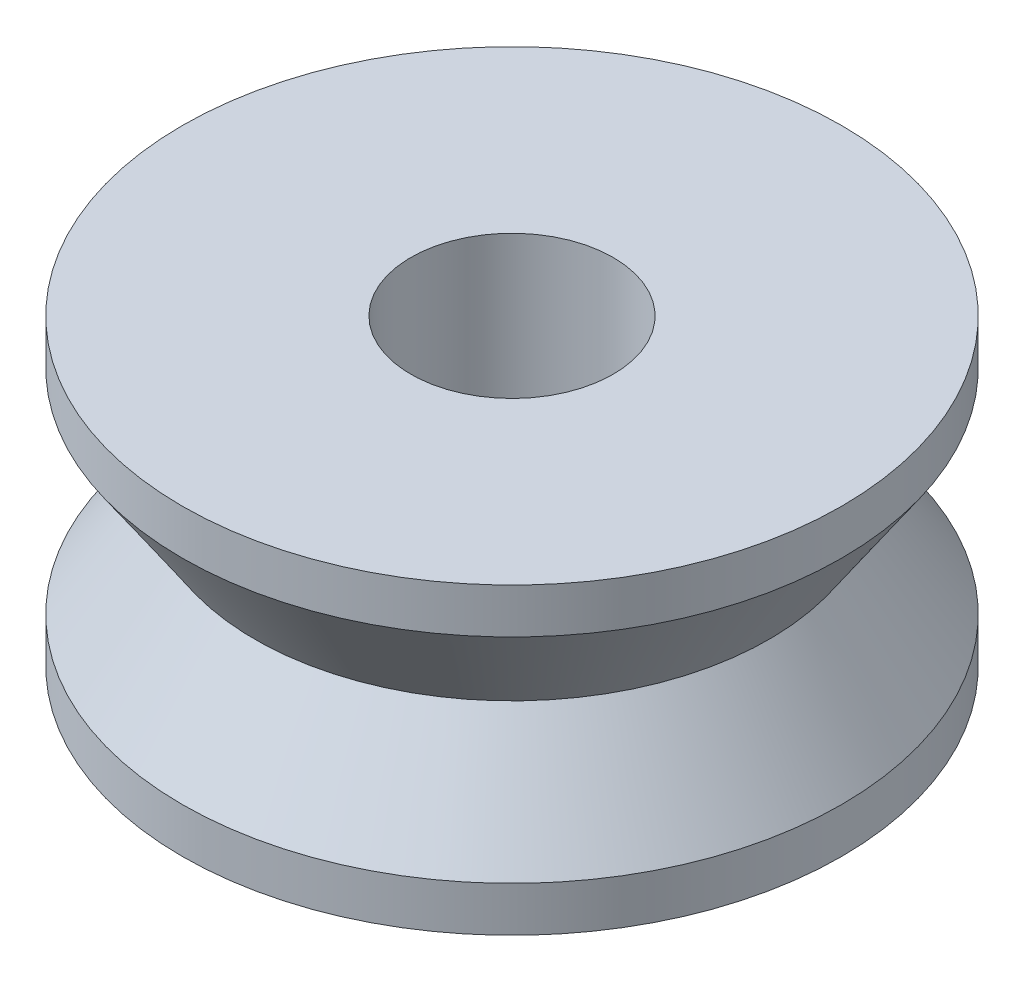
ISO-10303-21;
HEADER;
FILE_DESCRIPTION(('STEP AP214'),'2;1');
FILE_NAME('part.step','',(''),(''),'','','');
FILE_SCHEMA(('AUTOMOTIVE_DESIGN { 1 0 10303 214 1 1 1 1 }'));
ENDSEC;
DATA;
#1=APPLICATION_CONTEXT('core data for automotive mechanical design processes');
#2=APPLICATION_PROTOCOL_DEFINITION('international standard','automotive_design',2000,#1);
#3=PRODUCT_CONTEXT('',#1,'mechanical');
#4=PRODUCT('Part','Part','',(#3));
#5=PRODUCT_RELATED_PRODUCT_CATEGORY('part','',(#4));
#6=PRODUCT_DEFINITION_FORMATION('','',#4);
#7=PRODUCT_DEFINITION_CONTEXT('part definition',#1,'design');
#8=PRODUCT_DEFINITION('design','',#6,#7);
#9=PRODUCT_DEFINITION_SHAPE('','',#8);
#10=(LENGTH_UNIT() NAMED_UNIT(*) SI_UNIT(.MILLI.,.METRE.));
#11=(NAMED_UNIT(*) PLANE_ANGLE_UNIT() SI_UNIT($,.RADIAN.));
#12=(NAMED_UNIT(*) SI_UNIT($,.STERADIAN.) SOLID_ANGLE_UNIT());
#13=UNCERTAINTY_MEASURE_WITH_UNIT(LENGTH_MEASURE(1.E-05),#10,'distance_accuracy_value','');
#14=(GEOMETRIC_REPRESENTATION_CONTEXT(3) GLOBAL_UNCERTAINTY_ASSIGNED_CONTEXT((#13)) GLOBAL_UNIT_ASSIGNED_CONTEXT((#10,
#11,#12)) REPRESENTATION_CONTEXT('',''));
#15=CARTESIAN_POINT('',(0.,0.,0.));
#16=DIRECTION('',(0.,0.,1.));
#17=DIRECTION('',(1.,0.,0.));
#18=AXIS2_PLACEMENT_3D('',#15,#16,#17);
#19=CARTESIAN_POINT('',(0.,0.,0.));
#20=DIRECTION('',(0.,-1.,0.));
#21=DIRECTION('',(0.,0.,-1.));
#22=AXIS2_PLACEMENT_3D('',#19,#20,#21);
#23=CYLINDRICAL_SURFACE('',#22,2.);
#24=CARTESIAN_POINT('',(0.,-2.9972,0.));
#25=DIRECTION('',(0.,-1.,0.));
#26=DIRECTION('',(0.,0.,-1.));
#27=AXIS2_PLACEMENT_3D('',#24,#25,#26);
#28=CIRCLE('',#27,2.);
#29=CARTESIAN_POINT('',(0.,-2.9972,-2.));
#30=VERTEX_POINT('',#29);
#31=EDGE_CURVE('E72',#30,#30,#28,.T.);
#32=ORIENTED_EDGE('',*,*,#31,.T.);
#33=EDGE_LOOP('',(#32));
#34=FACE_BOUND('',#33,.T.);
#35=CARTESIAN_POINT('',(0.,2.9972,0.));
#36=DIRECTION('',(0.,-1.,0.));
#37=DIRECTION('',(0.,0.,-1.));
#38=AXIS2_PLACEMENT_3D('',#35,#36,#37);
#39=CIRCLE('',#38,2.);
#40=CARTESIAN_POINT('',(0.,2.9972,-2.));
#41=VERTEX_POINT('',#40);
#42=EDGE_CURVE('E10',#41,#41,#39,.T.);
#43=ORIENTED_EDGE('',*,*,#42,.F.);
#44=EDGE_LOOP('',(#43));
#45=FACE_BOUND('',#44,.T.);
#46=ADVANCED_FACE('F41',(#34,#45),#23,.F.);
#47=CARTESIAN_POINT('',(0.,2.9972,0.));
#48=DIRECTION('',(0.,1.,0.));
#49=DIRECTION('',(0.,0.,1.));
#50=AXIS2_PLACEMENT_3D('',#47,#48,#49);
#51=PLANE('',#50);
#52=ORIENTED_EDGE('',*,*,#42,.T.);
#53=EDGE_LOOP('',(#52));
#54=FACE_BOUND('',#53,.T.);
#55=CARTESIAN_POINT('',(0.,2.9972,0.));
#56=DIRECTION('',(0.,-1.,0.));
#57=DIRECTION('',(0.,0.,-1.));
#58=AXIS2_PLACEMENT_3D('',#55,#56,#57);
#59=CIRCLE('',#58,6.5151);
#60=CARTESIAN_POINT('',(0.,2.9972,-6.5151));
#61=VERTEX_POINT('',#60);
#62=EDGE_CURVE('E48',#61,#61,#59,.T.);
#63=ORIENTED_EDGE('',*,*,#62,.F.);
#64=EDGE_LOOP('',(#63));
#65=FACE_BOUND('',#64,.T.);
#66=ADVANCED_FACE('F97',(#54,#65),#51,.T.);
#67=CARTESIAN_POINT('',(0.,0.,0.));
#68=DIRECTION('',(0.,-1.,0.));
#69=DIRECTION('',(0.,0.,-1.));
#70=AXIS2_PLACEMENT_3D('',#67,#68,#69);
#71=CYLINDRICAL_SURFACE('',#70,6.5151);
#72=CARTESIAN_POINT('',(0.,2.1082,0.));
#73=DIRECTION('',(0.,-1.,0.));
#74=DIRECTION('',(0.,0.,-1.));
#75=AXIS2_PLACEMENT_3D('',#72,#73,#74);
#76=CIRCLE('',#75,6.5151);
#77=CARTESIAN_POINT('',(0.,2.1082,-6.5151));
#78=VERTEX_POINT('',#77);
#79=EDGE_CURVE('E53',#78,#78,#76,.T.);
#80=ORIENTED_EDGE('',*,*,#79,.F.);
#81=EDGE_LOOP('',(#80));
#82=FACE_BOUND('',#81,.T.);
#83=ORIENTED_EDGE('',*,*,#62,.T.);
#84=EDGE_LOOP('',(#83));
#85=FACE_BOUND('',#84,.T.);
#86=ADVANCED_FACE('F101',(#82,#85),#71,.T.);
#87=CARTESIAN_POINT('',(0.,2.1082,0.));
#88=DIRECTION('',(0.,1.,0.));
#89=DIRECTION('',(0.,0.,1.));
#90=AXIS2_PLACEMENT_3D('',#87,#88,#89);
#91=CONICAL_SURFACE('',#90,6.5151,0.59767081058087);
#92=CARTESIAN_POINT('',(0.,0.,0.));
#93=DIRECTION('',(0.,-1.,0.));
#94=DIRECTION('',(0.,0.,-1.));
#95=AXIS2_PLACEMENT_3D('',#92,#93,#94);
#96=CIRCLE('',#95,5.08);
#97=CARTESIAN_POINT('',(0.,0.,-5.08));
#98=VERTEX_POINT('',#97);
#99=EDGE_CURVE('E58',#98,#98,#96,.T.);
#100=ORIENTED_EDGE('',*,*,#99,.F.);
#101=EDGE_LOOP('',(#100));
#102=FACE_BOUND('',#101,.T.);
#103=ORIENTED_EDGE('',*,*,#79,.T.);
#104=EDGE_LOOP('',(#103));
#105=FACE_BOUND('',#104,.T.);
#106=ADVANCED_FACE('F93',(#102,#105),#91,.T.);
#107=CARTESIAN_POINT('',(0.,-2.1082,0.));
#108=DIRECTION('',(0.,-1.,0.));
#109=DIRECTION('',(0.,0.,-1.));
#110=AXIS2_PLACEMENT_3D('',#107,#108,#109);
#111=CONICAL_SURFACE('',#110,6.5151,0.59767081058087);
#112=ORIENTED_EDGE('',*,*,#99,.T.);
#113=EDGE_LOOP('',(#112));
#114=FACE_BOUND('',#113,.T.);
#115=CARTESIAN_POINT('',(0.,-2.1082,0.));
#116=DIRECTION('',(0.,-1.,0.));
#117=DIRECTION('',(0.,0.,-1.));
#118=AXIS2_PLACEMENT_3D('',#115,#116,#117);
#119=CIRCLE('',#118,6.5151);
#120=CARTESIAN_POINT('',(0.,-2.1082,-6.5151));
#121=VERTEX_POINT('',#120);
#122=EDGE_CURVE('E64',#121,#121,#119,.T.);
#123=ORIENTED_EDGE('',*,*,#122,.F.);
#124=EDGE_LOOP('',(#123));
#125=FACE_BOUND('',#124,.T.);
#126=ADVANCED_FACE('F87',(#114,#125),#111,.T.);
#127=CARTESIAN_POINT('',(0.,0.,0.));
#128=DIRECTION('',(0.,-1.,0.));
#129=DIRECTION('',(0.,0.,-1.));
#130=AXIS2_PLACEMENT_3D('',#127,#128,#129);
#131=CYLINDRICAL_SURFACE('',#130,6.5151);
#132=ORIENTED_EDGE('',*,*,#122,.T.);
#133=EDGE_LOOP('',(#132));
#134=FACE_BOUND('',#133,.T.);
#135=CARTESIAN_POINT('',(0.,-2.9972,0.));
#136=DIRECTION('',(0.,-1.,0.));
#137=DIRECTION('',(0.,0.,-1.));
#138=AXIS2_PLACEMENT_3D('',#135,#136,#137);
#139=CIRCLE('',#138,6.5151);
#140=CARTESIAN_POINT('',(0.,-2.9972,-6.5151));
#141=VERTEX_POINT('',#140);
#142=EDGE_CURVE('E68',#141,#141,#139,.T.);
#143=ORIENTED_EDGE('',*,*,#142,.F.);
#144=EDGE_LOOP('',(#143));
#145=FACE_BOUND('',#144,.T.);
#146=ADVANCED_FACE('F82',(#134,#145),#131,.T.);
#147=CARTESIAN_POINT('',(0.,-2.9972,0.));
#148=DIRECTION('',(0.,1.,0.));
#149=DIRECTION('',(0.,0.,1.));
#150=AXIS2_PLACEMENT_3D('',#147,#148,#149);
#151=PLANE('',#150);
#152=ORIENTED_EDGE('',*,*,#31,.F.);
#153=EDGE_LOOP('',(#152));
#154=FACE_BOUND('',#153,.T.);
#155=ORIENTED_EDGE('',*,*,#142,.T.);
#156=EDGE_LOOP('',(#155));
#157=FACE_BOUND('',#156,.T.);
#158=ADVANCED_FACE('F79',(#154,#157),#151,.F.);
#159=CLOSED_SHELL('',(#46,#66,#86,#106,#126,#146,#158));
#160=MANIFOLD_SOLID_BREP('B2',#159);
#161=ADVANCED_BREP_SHAPE_REPRESENTATION('',(#18,#160),#14);
#162=SHAPE_DEFINITION_REPRESENTATION(#9,#161);
ENDSEC;
END-ISO-10303-21;
